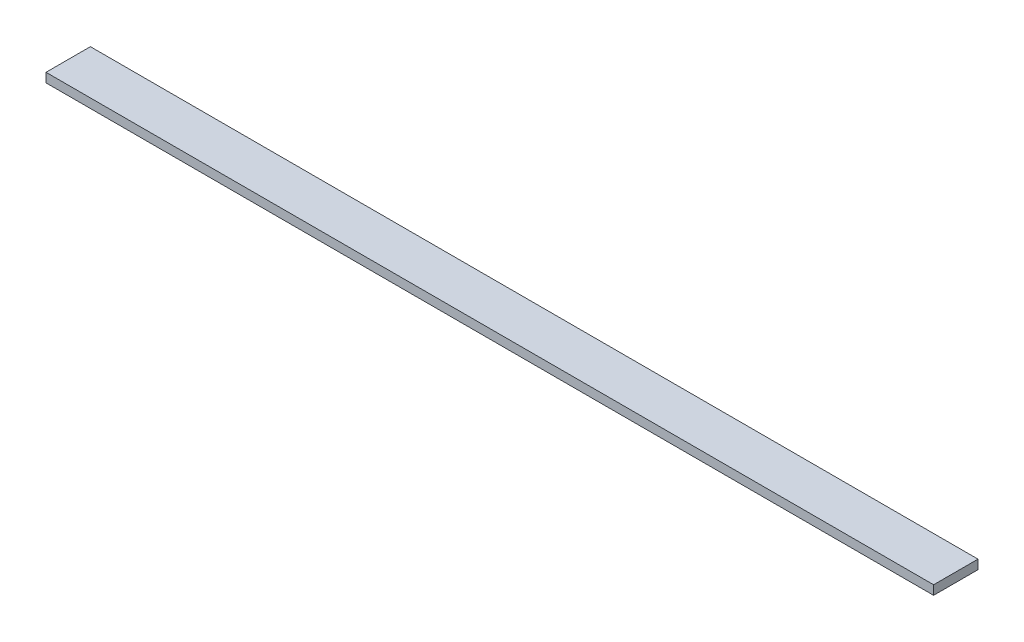
ISO-10303-21;
HEADER;
FILE_DESCRIPTION(('STEP AP214'),'2;1');
FILE_NAME('part.step','',(''),(''),'','','');
FILE_SCHEMA(('AUTOMOTIVE_DESIGN { 1 0 10303 214 1 1 1 1 }'));
ENDSEC;
DATA;
#1=APPLICATION_CONTEXT('core data for automotive mechanical design processes');
#2=APPLICATION_PROTOCOL_DEFINITION('international standard','automotive_design',2000,#1);
#3=PRODUCT_CONTEXT('',#1,'mechanical');
#4=PRODUCT('Part','Part','',(#3));
#5=PRODUCT_RELATED_PRODUCT_CATEGORY('part','',(#4));
#6=PRODUCT_DEFINITION_FORMATION('','',#4);
#7=PRODUCT_DEFINITION_CONTEXT('part definition',#1,'design');
#8=PRODUCT_DEFINITION('design','',#6,#7);
#9=PRODUCT_DEFINITION_SHAPE('','',#8);
#10=(LENGTH_UNIT() NAMED_UNIT(*) SI_UNIT(.MILLI.,.METRE.));
#11=(NAMED_UNIT(*) PLANE_ANGLE_UNIT() SI_UNIT($,.RADIAN.));
#12=(NAMED_UNIT(*) SI_UNIT($,.STERADIAN.) SOLID_ANGLE_UNIT());
#13=UNCERTAINTY_MEASURE_WITH_UNIT(LENGTH_MEASURE(1.E-05),#10,'distance_accuracy_value','');
#14=(GEOMETRIC_REPRESENTATION_CONTEXT(3) GLOBAL_UNCERTAINTY_ASSIGNED_CONTEXT((#13)) GLOBAL_UNIT_ASSIGNED_CONTEXT((#10,
#11,#12)) REPRESENTATION_CONTEXT('',''));
#15=CARTESIAN_POINT('',(0.,0.,0.));
#16=DIRECTION('',(0.,0.,1.));
#17=DIRECTION('',(1.,0.,0.));
#18=AXIS2_PLACEMENT_3D('',#15,#16,#17);
#19=CARTESIAN_POINT('',(-76.2,1.5748,-3.81));
#20=DIRECTION('',(1.,0.,0.));
#21=DIRECTION('',(0.,0.,-1.));
#22=AXIS2_PLACEMENT_3D('',#19,#20,#21);
#23=PLANE('',#22);
#24=DIRECTION('',(0.,0.,1.));
#25=VECTOR('',#24,1.);
#26=CARTESIAN_POINT('',(-76.2,0.,-3.81));
#27=LINE('',#26,#25);
#28=CARTESIAN_POINT('',(-76.2,0.,-3.81));
#29=VERTEX_POINT('',#28);
#30=CARTESIAN_POINT('',(-76.2,0.,3.81));
#31=VERTEX_POINT('',#30);
#32=EDGE_CURVE('E96',#29,#31,#27,.T.);
#33=ORIENTED_EDGE('',*,*,#32,.T.);
#34=DIRECTION('',(0.,-1.,0.));
#35=VECTOR('',#34,1.);
#36=CARTESIAN_POINT('',(-76.2,1.5748,3.81));
#37=LINE('',#36,#35);
#38=CARTESIAN_POINT('',(-76.2,1.5748,3.81));
#39=VERTEX_POINT('',#38);
#40=EDGE_CURVE('E11',#39,#31,#37,.T.);
#41=ORIENTED_EDGE('',*,*,#40,.F.);
#42=DIRECTION('',(0.,0.,1.));
#43=VECTOR('',#42,1.);
#44=CARTESIAN_POINT('',(-76.2,1.5748,-3.81));
#45=LINE('',#44,#43);
#46=CARTESIAN_POINT('',(-76.2,1.5748,-3.81));
#47=VERTEX_POINT('',#46);
#48=EDGE_CURVE('E84',#47,#39,#45,.T.);
#49=ORIENTED_EDGE('',*,*,#48,.F.);
#50=DIRECTION('',(0.,-1.,0.));
#51=VECTOR('',#50,1.);
#52=CARTESIAN_POINT('',(-76.2,1.5748,-3.81));
#53=LINE('',#52,#51);
#54=EDGE_CURVE('E92',#47,#29,#53,.T.);
#55=ORIENTED_EDGE('',*,*,#54,.T.);
#56=EDGE_LOOP('',(#33,#41,#49,#55));
#57=FACE_BOUND('',#56,.T.);
#58=ADVANCED_FACE('F33',(#57),#23,.F.);
#59=CARTESIAN_POINT('',(76.2,1.5748,3.81));
#60=DIRECTION('',(0.,0.,-1.));
#61=DIRECTION('',(-1.,0.,0.));
#62=AXIS2_PLACEMENT_3D('',#59,#60,#61);
#63=PLANE('',#62);
#64=DIRECTION('',(1.,0.,0.));
#65=VECTOR('',#64,1.);
#66=CARTESIAN_POINT('',(76.2,0.,3.81));
#67=LINE('',#66,#65);
#68=CARTESIAN_POINT('',(76.2,0.,3.81));
#69=VERTEX_POINT('',#68);
#70=EDGE_CURVE('E88',#31,#69,#67,.T.);
#71=ORIENTED_EDGE('',*,*,#70,.T.);
#72=DIRECTION('',(0.,-1.,0.));
#73=VECTOR('',#72,1.);
#74=CARTESIAN_POINT('',(76.2,1.5748,3.81));
#75=LINE('',#74,#73);
#76=CARTESIAN_POINT('',(76.2,1.5748,3.81));
#77=VERTEX_POINT('',#76);
#78=EDGE_CURVE('E41',#77,#69,#75,.T.);
#79=ORIENTED_EDGE('',*,*,#78,.F.);
#80=DIRECTION('',(1.,0.,0.));
#81=VECTOR('',#80,1.);
#82=CARTESIAN_POINT('',(76.2,1.5748,3.81));
#83=LINE('',#82,#81);
#84=EDGE_CURVE('E79',#39,#77,#83,.T.);
#85=ORIENTED_EDGE('',*,*,#84,.F.);
#86=ORIENTED_EDGE('',*,*,#40,.T.);
#87=EDGE_LOOP('',(#71,#79,#85,#86));
#88=FACE_BOUND('',#87,.T.);
#89=ADVANCED_FACE('F87',(#88),#63,.F.);
#90=CARTESIAN_POINT('',(76.2,1.5748,3.81));
#91=DIRECTION('',(-1.,0.,0.));
#92=DIRECTION('',(0.,0.,1.));
#93=AXIS2_PLACEMENT_3D('',#90,#91,#92);
#94=PLANE('',#93);
#95=DIRECTION('',(0.,0.,-1.));
#96=VECTOR('',#95,1.);
#97=CARTESIAN_POINT('',(76.2,0.,3.81));
#98=LINE('',#97,#96);
#99=CARTESIAN_POINT('',(76.2,0.,-3.81));
#100=VERTEX_POINT('',#99);
#101=EDGE_CURVE('E66',#69,#100,#98,.T.);
#102=ORIENTED_EDGE('',*,*,#101,.T.);
#103=DIRECTION('',(0.,-1.,0.));
#104=VECTOR('',#103,1.);
#105=CARTESIAN_POINT('',(76.2,1.5748,-3.81));
#106=LINE('',#105,#104);
#107=CARTESIAN_POINT('',(76.2,1.5748,-3.81));
#108=VERTEX_POINT('',#107);
#109=EDGE_CURVE('E89',#108,#100,#106,.T.);
#110=ORIENTED_EDGE('',*,*,#109,.F.);
#111=DIRECTION('',(0.,0.,-1.));
#112=VECTOR('',#111,1.);
#113=CARTESIAN_POINT('',(76.2,1.5748,3.81));
#114=LINE('',#113,#112);
#115=EDGE_CURVE('E82',#77,#108,#114,.T.);
#116=ORIENTED_EDGE('',*,*,#115,.F.);
#117=ORIENTED_EDGE('',*,*,#78,.T.);
#118=EDGE_LOOP('',(#102,#110,#116,#117));
#119=FACE_BOUND('',#118,.T.);
#120=ADVANCED_FACE('F90',(#119),#94,.F.);
#121=CARTESIAN_POINT('',(76.2,1.5748,-3.81));
#122=DIRECTION('',(0.,0.,1.));
#123=DIRECTION('',(1.,0.,0.));
#124=AXIS2_PLACEMENT_3D('',#121,#122,#123);
#125=PLANE('',#124);
#126=DIRECTION('',(-1.,0.,0.));
#127=VECTOR('',#126,1.);
#128=CARTESIAN_POINT('',(76.2,0.,-3.81));
#129=LINE('',#128,#127);
#130=EDGE_CURVE('E72',#100,#29,#129,.T.);
#131=ORIENTED_EDGE('',*,*,#130,.T.);
#132=ORIENTED_EDGE('',*,*,#54,.F.);
#133=DIRECTION('',(-1.,0.,0.));
#134=VECTOR('',#133,1.);
#135=CARTESIAN_POINT('',(76.2,1.5748,-3.81));
#136=LINE('',#135,#134);
#137=EDGE_CURVE('E49',#108,#47,#136,.T.);
#138=ORIENTED_EDGE('',*,*,#137,.F.);
#139=ORIENTED_EDGE('',*,*,#109,.T.);
#140=EDGE_LOOP('',(#131,#132,#138,#139));
#141=FACE_BOUND('',#140,.T.);
#142=ADVANCED_FACE('F103',(#141),#125,.F.);
#143=CARTESIAN_POINT('',(0.,1.5748,0.));
#144=DIRECTION('',(0.,-1.,0.));
#145=DIRECTION('',(0.,0.,-1.));
#146=AXIS2_PLACEMENT_3D('',#143,#144,#145);
#147=PLANE('',#146);
#148=ORIENTED_EDGE('',*,*,#48,.T.);
#149=ORIENTED_EDGE('',*,*,#84,.T.);
#150=ORIENTED_EDGE('',*,*,#115,.T.);
#151=ORIENTED_EDGE('',*,*,#137,.T.);
#152=EDGE_LOOP('',(#148,#149,#150,#151));
#153=FACE_BOUND('',#152,.T.);
#154=ADVANCED_FACE('F80',(#153),#147,.F.);
#155=CARTESIAN_POINT('',(0.,0.,0.));
#156=DIRECTION('',(0.,-1.,0.));
#157=DIRECTION('',(0.,0.,-1.));
#158=AXIS2_PLACEMENT_3D('',#155,#156,#157);
#159=PLANE('',#158);
#160=ORIENTED_EDGE('',*,*,#32,.F.);
#161=ORIENTED_EDGE('',*,*,#130,.F.);
#162=ORIENTED_EDGE('',*,*,#101,.F.);
#163=ORIENTED_EDGE('',*,*,#70,.F.);
#164=EDGE_LOOP('',(#160,#161,#162,#163));
#165=FACE_BOUND('',#164,.T.);
#166=ADVANCED_FACE('F106',(#165),#159,.T.);
#167=CLOSED_SHELL('',(#58,#89,#120,#142,#154,#166));
#168=MANIFOLD_SOLID_BREP('B2',#167);
#169=ADVANCED_BREP_SHAPE_REPRESENTATION('',(#18,#168),#14);
#170=SHAPE_DEFINITION_REPRESENTATION(#9,#169);
ENDSEC;
END-ISO-10303-21;
